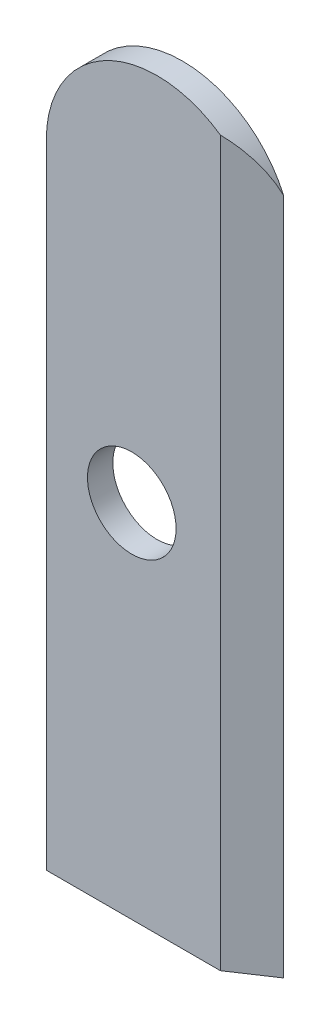
ISO-10303-21;
HEADER;
FILE_DESCRIPTION(('STEP AP214'),'2;1');
FILE_NAME('part.step','',(''),(''),'','','');
FILE_SCHEMA(('AUTOMOTIVE_DESIGN { 1 0 10303 214 1 1 1 1 }'));
ENDSEC;
DATA;
#1=APPLICATION_CONTEXT('core data for automotive mechanical design processes');
#2=APPLICATION_PROTOCOL_DEFINITION('international standard','automotive_design',2000,#1);
#3=PRODUCT_CONTEXT('',#1,'mechanical');
#4=PRODUCT('Part','Part','',(#3));
#5=PRODUCT_RELATED_PRODUCT_CATEGORY('part','',(#4));
#6=PRODUCT_DEFINITION_FORMATION('','',#4);
#7=PRODUCT_DEFINITION_CONTEXT('part definition',#1,'design');
#8=PRODUCT_DEFINITION('design','',#6,#7);
#9=PRODUCT_DEFINITION_SHAPE('','',#8);
#10=(LENGTH_UNIT() NAMED_UNIT(*) SI_UNIT(.MILLI.,.METRE.));
#11=(NAMED_UNIT(*) PLANE_ANGLE_UNIT() SI_UNIT($,.RADIAN.));
#12=(NAMED_UNIT(*) SI_UNIT($,.STERADIAN.) SOLID_ANGLE_UNIT());
#13=UNCERTAINTY_MEASURE_WITH_UNIT(LENGTH_MEASURE(1.E-05),#10,'distance_accuracy_value','');
#14=(GEOMETRIC_REPRESENTATION_CONTEXT(3) GLOBAL_UNCERTAINTY_ASSIGNED_CONTEXT((#13)) GLOBAL_UNIT_ASSIGNED_CONTEXT((#10,
#11,#12)) REPRESENTATION_CONTEXT('',''));
#15=CARTESIAN_POINT('',(0.,0.,0.));
#16=DIRECTION('',(0.,0.,1.));
#17=DIRECTION('',(1.,0.,0.));
#18=AXIS2_PLACEMENT_3D('',#15,#16,#17);
#19=CARTESIAN_POINT('',(-3.5,20.,0.8));
#20=DIRECTION('',(0.,0.,-1.));
#21=DIRECTION('',(-1.,0.,0.));
#22=AXIS2_PLACEMENT_3D('',#19,#20,#21);
#23=CYLINDRICAL_SURFACE('',#22,3.5);
#24=CARTESIAN_POINT('',(-3.5,20.,0.8));
#25=DIRECTION('',(0.,0.,1.));
#26=DIRECTION('',(1.,0.,0.));
#27=AXIS2_PLACEMENT_3D('',#24,#25,#26);
#28=CIRCLE('',#27,3.5);
#29=CARTESIAN_POINT('',(-7.,20.,0.8));
#30=VERTEX_POINT('',#29);
#31=CARTESIAN_POINT('',(-1.50000000000001,22.872281323269,0.8));
#32=VERTEX_POINT('',#31);
#33=EDGE_CURVE('E77',#30,#32,#28,.F.);
#34=ORIENTED_EDGE('',*,*,#33,.T.);
#35=CARTESIAN_POINT('',(-3.5,20.,2.13333333333332));
#36=DIRECTION('',(0.554700196225228,0.,0.832050294337845));
#37=DIRECTION('',(0.832050294337844,0.,-0.554700196225228));
#38=AXIS2_PLACEMENT_3D('',#35,#36,#37);
#39=ELLIPSE('',#38,4.20647648804132,3.5);
#40=CARTESIAN_POINT('',(-0.300000000000001,21.4177446878758,0.));
#41=VERTEX_POINT('',#40);
#42=EDGE_CURVE('E43',#32,#41,#39,.F.);
#43=ORIENTED_EDGE('',*,*,#42,.T.);
#44=CARTESIAN_POINT('',(-3.5,20.,0.));
#45=DIRECTION('',(0.,0.,1.));
#46=DIRECTION('',(1.,0.,0.));
#47=AXIS2_PLACEMENT_3D('',#44,#45,#46);
#48=CIRCLE('',#47,3.5);
#49=CARTESIAN_POINT('',(-7.,20.,0.));
#50=VERTEX_POINT('',#49);
#51=EDGE_CURVE('E79',#50,#41,#48,.F.);
#52=ORIENTED_EDGE('',*,*,#51,.F.);
#53=DIRECTION('',(0.,0.,-1.));
#54=VECTOR('',#53,1.);
#55=CARTESIAN_POINT('',(-7.,20.,0.8));
#56=LINE('',#55,#54);
#57=EDGE_CURVE('E75',#30,#50,#56,.T.);
#58=ORIENTED_EDGE('',*,*,#57,.F.);
#59=EDGE_LOOP('',(#34,#43,#52,#58));
#60=FACE_BOUND('',#59,.T.);
#61=ADVANCED_FACE('F35',(#60),#23,.T.);
#62=CARTESIAN_POINT('',(-7.,0.,0.8));
#63=DIRECTION('',(-1.,0.,0.));
#64=DIRECTION('',(0.,-1.,0.));
#65=AXIS2_PLACEMENT_3D('',#62,#63,#64);
#66=PLANE('',#65);
#67=DIRECTION('',(0.,1.,0.));
#68=VECTOR('',#67,1.);
#69=CARTESIAN_POINT('',(-7.,0.,0.));
#70=LINE('',#69,#68);
#71=CARTESIAN_POINT('',(-7.,0.,0.));
#72=VERTEX_POINT('',#71);
#73=EDGE_CURVE('E101',#72,#50,#70,.T.);
#74=ORIENTED_EDGE('',*,*,#73,.F.);
#75=DIRECTION('',(0.,0.,-1.));
#76=VECTOR('',#75,1.);
#77=CARTESIAN_POINT('',(-7.,0.,0.8));
#78=LINE('',#77,#76);
#79=CARTESIAN_POINT('',(-7.,0.,0.8));
#80=VERTEX_POINT('',#79);
#81=EDGE_CURVE('E85',#80,#72,#78,.T.);
#82=ORIENTED_EDGE('',*,*,#81,.F.);
#83=DIRECTION('',(0.,1.,0.));
#84=VECTOR('',#83,1.);
#85=CARTESIAN_POINT('',(-7.,0.,0.8));
#86=LINE('',#85,#84);
#87=EDGE_CURVE('E90',#80,#30,#86,.T.);
#88=ORIENTED_EDGE('',*,*,#87,.T.);
#89=ORIENTED_EDGE('',*,*,#57,.T.);
#90=EDGE_LOOP('',(#74,#82,#88,#89));
#91=FACE_BOUND('',#90,.T.);
#92=ADVANCED_FACE('F94',(#91),#66,.T.);
#93=CARTESIAN_POINT('',(0.,0.,0.8));
#94=DIRECTION('',(0.,-1.,0.));
#95=DIRECTION('',(0.,0.,-1.));
#96=AXIS2_PLACEMENT_3D('',#93,#94,#95);
#97=PLANE('',#96);
#98=DIRECTION('',(-1.,0.,0.));
#99=VECTOR('',#98,1.);
#100=CARTESIAN_POINT('',(0.,0.,0.));
#101=LINE('',#100,#99);
#102=CARTESIAN_POINT('',(-0.300000000000001,0.,0.));
#103=VERTEX_POINT('',#102);
#104=EDGE_CURVE('E104',#103,#72,#101,.T.);
#105=ORIENTED_EDGE('',*,*,#104,.F.);
#106=DIRECTION('',(-0.832050294337844,0.,0.554700196225228));
#107=VECTOR('',#106,1.);
#108=CARTESIAN_POINT('',(-0.461538461538463,0.,0.107692307692304));
#109=LINE('',#108,#107);
#110=CARTESIAN_POINT('',(-1.50000000000001,0.,0.8));
#111=VERTEX_POINT('',#110);
#112=EDGE_CURVE('E11',#103,#111,#109,.T.);
#113=ORIENTED_EDGE('',*,*,#112,.T.);
#114=DIRECTION('',(-1.,0.,0.));
#115=VECTOR('',#114,1.);
#116=CARTESIAN_POINT('',(0.,0.,0.8));
#117=LINE('',#116,#115);
#118=EDGE_CURVE('E95',#111,#80,#117,.T.);
#119=ORIENTED_EDGE('',*,*,#118,.T.);
#120=ORIENTED_EDGE('',*,*,#81,.T.);
#121=EDGE_LOOP('',(#105,#113,#119,#120));
#122=FACE_BOUND('',#121,.T.);
#123=ADVANCED_FACE('F125',(#122),#97,.T.);
#124=CARTESIAN_POINT('',(0.,0.,0.8));
#125=DIRECTION('',(0.,0.,1.));
#126=DIRECTION('',(1.,0.,0.));
#127=AXIS2_PLACEMENT_3D('',#124,#125,#126);
#128=PLANE('',#127);
#129=CARTESIAN_POINT('',(-4.3,11.4,0.8));
#130=DIRECTION('',(0.,0.,1.));
#131=DIRECTION('',(1.,0.,0.));
#132=AXIS2_PLACEMENT_3D('',#129,#130,#131);
#133=CIRCLE('',#132,1.4);
#134=CARTESIAN_POINT('',(-2.9,11.4,0.8));
#135=VERTEX_POINT('',#134);
#136=EDGE_CURVE('E136',#135,#135,#133,.T.);
#137=ORIENTED_EDGE('',*,*,#136,.F.);
#138=EDGE_LOOP('',(#137));
#139=FACE_BOUND('',#138,.T.);
#140=ORIENTED_EDGE('',*,*,#118,.F.);
#141=DIRECTION('',(0.,1.,0.));
#142=VECTOR('',#141,1.);
#143=CARTESIAN_POINT('',(-1.50000000000001,21.4177446878758,0.8));
#144=LINE('',#143,#142);
#145=EDGE_CURVE('E84',#111,#32,#144,.T.);
#146=ORIENTED_EDGE('',*,*,#145,.T.);
#147=ORIENTED_EDGE('',*,*,#33,.F.);
#148=ORIENTED_EDGE('',*,*,#87,.F.);
#149=EDGE_LOOP('',(#140,#146,#147,#148));
#150=FACE_BOUND('',#149,.T.);
#151=ADVANCED_FACE('F89',(#139,#150),#128,.T.);
#152=CARTESIAN_POINT('',(0.,0.,0.));
#153=DIRECTION('',(0.,0.,1.));
#154=DIRECTION('',(1.,0.,0.));
#155=AXIS2_PLACEMENT_3D('',#152,#153,#154);
#156=PLANE('',#155);
#157=CARTESIAN_POINT('',(-4.3,11.4,0.));
#158=DIRECTION('',(0.,0.,1.));
#159=DIRECTION('',(1.,0.,0.));
#160=AXIS2_PLACEMENT_3D('',#157,#158,#159);
#161=CIRCLE('',#160,1.4);
#162=CARTESIAN_POINT('',(-2.9,11.4,0.));
#163=VERTEX_POINT('',#162);
#164=EDGE_CURVE('E102',#163,#163,#161,.F.);
#165=ORIENTED_EDGE('',*,*,#164,.F.);
#166=EDGE_LOOP('',(#165));
#167=FACE_BOUND('',#166,.T.);
#168=ORIENTED_EDGE('',*,*,#51,.T.);
#169=DIRECTION('',(0.,1.,0.));
#170=VECTOR('',#169,1.);
#171=CARTESIAN_POINT('',(-0.300000000000001,0.,0.));
#172=LINE('',#171,#170);
#173=EDGE_CURVE('E91',#103,#41,#172,.T.);
#174=ORIENTED_EDGE('',*,*,#173,.F.);
#175=ORIENTED_EDGE('',*,*,#104,.T.);
#176=ORIENTED_EDGE('',*,*,#73,.T.);
#177=EDGE_LOOP('',(#168,#174,#175,#176));
#178=FACE_BOUND('',#177,.T.);
#179=ADVANCED_FACE('F110',(#167,#178),#156,.F.);
#180=CARTESIAN_POINT('',(-1.50000000000001,0.,0.8));
#181=DIRECTION('',(0.554700196225228,0.,0.832050294337845));
#182=DIRECTION('',(0.,-1.,0.));
#183=AXIS2_PLACEMENT_3D('',#180,#181,#182);
#184=PLANE('',#183);
#185=ORIENTED_EDGE('',*,*,#112,.F.);
#186=ORIENTED_EDGE('',*,*,#173,.T.);
#187=ORIENTED_EDGE('',*,*,#42,.F.);
#188=ORIENTED_EDGE('',*,*,#145,.F.);
#189=EDGE_LOOP('',(#185,#186,#187,#188));
#190=FACE_BOUND('',#189,.T.);
#191=ADVANCED_FACE('F37',(#190),#184,.T.);
#192=CARTESIAN_POINT('',(-4.3,11.4,-0.00100000000000002));
#193=DIRECTION('',(0.,0.,1.));
#194=DIRECTION('',(1.,0.,0.));
#195=AXIS2_PLACEMENT_3D('',#192,#193,#194);
#196=CYLINDRICAL_SURFACE('',#195,1.4);
#197=CARTESIAN_POINT('',(-2.9,11.4,0.8));
#198=CARTESIAN_POINT('',(-2.9,11.4,0.791666666666667));
#199=CARTESIAN_POINT('',(-2.9,11.4,0.783333333333333));
#200=CARTESIAN_POINT('',(-2.9,11.4,0.766666666666667));
#201=CARTESIAN_POINT('',(-2.9,11.4,0.758333333333333));
#202=CARTESIAN_POINT('',(-2.9,11.4,0.741666666666667));
#203=CARTESIAN_POINT('',(-2.9,11.4,0.733333333333333));
#204=CARTESIAN_POINT('',(-2.9,11.4,0.716666666666667));
#205=CARTESIAN_POINT('',(-2.9,11.4,0.708333333333333));
#206=CARTESIAN_POINT('',(-2.9,11.4,0.691666666666667));
#207=CARTESIAN_POINT('',(-2.9,11.4,0.683333333333333));
#208=CARTESIAN_POINT('',(-2.9,11.4,0.666666666666667));
#209=CARTESIAN_POINT('',(-2.9,11.4,0.658333333333333));
#210=CARTESIAN_POINT('',(-2.9,11.4,0.641666666666667));
#211=CARTESIAN_POINT('',(-2.9,11.4,0.633333333333333));
#212=CARTESIAN_POINT('',(-2.9,11.4,0.616666666666667));
#213=CARTESIAN_POINT('',(-2.9,11.4,0.608333333333333));
#214=CARTESIAN_POINT('',(-2.9,11.4,0.591666666666667));
#215=CARTESIAN_POINT('',(-2.9,11.4,0.583333333333333));
#216=CARTESIAN_POINT('',(-2.9,11.4,0.566666666666667));
#217=CARTESIAN_POINT('',(-2.9,11.4,0.558333333333333));
#218=CARTESIAN_POINT('',(-2.9,11.4,0.541666666666667));
#219=CARTESIAN_POINT('',(-2.9,11.4,0.533333333333333));
#220=CARTESIAN_POINT('',(-2.9,11.4,0.516666666666667));
#221=CARTESIAN_POINT('',(-2.9,11.4,0.508333333333333));
#222=CARTESIAN_POINT('',(-2.9,11.4,0.491666666666667));
#223=CARTESIAN_POINT('',(-2.9,11.4,0.483333333333333));
#224=CARTESIAN_POINT('',(-2.9,11.4,0.466666666666667));
#225=CARTESIAN_POINT('',(-2.9,11.4,0.458333333333333));
#226=CARTESIAN_POINT('',(-2.9,11.4,0.441666666666667));
#227=CARTESIAN_POINT('',(-2.9,11.4,0.433333333333333));
#228=CARTESIAN_POINT('',(-2.9,11.4,0.416666666666667));
#229=CARTESIAN_POINT('',(-2.9,11.4,0.408333333333333));
#230=CARTESIAN_POINT('',(-2.9,11.4,0.391666666666667));
#231=CARTESIAN_POINT('',(-2.9,11.4,0.383333333333333));
#232=CARTESIAN_POINT('',(-2.9,11.4,0.366666666666667));
#233=CARTESIAN_POINT('',(-2.9,11.4,0.358333333333333));
#234=CARTESIAN_POINT('',(-2.9,11.4,0.341666666666667));
#235=CARTESIAN_POINT('',(-2.9,11.4,0.333333333333333));
#236=CARTESIAN_POINT('',(-2.9,11.4,0.316666666666667));
#237=CARTESIAN_POINT('',(-2.9,11.4,0.308333333333333));
#238=CARTESIAN_POINT('',(-2.9,11.4,0.291666666666667));
#239=CARTESIAN_POINT('',(-2.9,11.4,0.283333333333333));
#240=CARTESIAN_POINT('',(-2.9,11.4,0.266666666666667));
#241=CARTESIAN_POINT('',(-2.9,11.4,0.258333333333333));
#242=CARTESIAN_POINT('',(-2.9,11.4,0.241666666666667));
#243=CARTESIAN_POINT('',(-2.9,11.4,0.233333333333333));
#244=CARTESIAN_POINT('',(-2.9,11.4,0.216666666666667));
#245=CARTESIAN_POINT('',(-2.9,11.4,0.208333333333333));
#246=CARTESIAN_POINT('',(-2.9,11.4,0.191666666666667));
#247=CARTESIAN_POINT('',(-2.9,11.4,0.183333333333333));
#248=CARTESIAN_POINT('',(-2.9,11.4,0.166666666666667));
#249=CARTESIAN_POINT('',(-2.9,11.4,0.158333333333333));
#250=CARTESIAN_POINT('',(-2.9,11.4,0.141666666666667));
#251=CARTESIAN_POINT('',(-2.9,11.4,0.133333333333333));
#252=CARTESIAN_POINT('',(-2.9,11.4,0.116666666666667));
#253=CARTESIAN_POINT('',(-2.9,11.4,0.108333333333333));
#254=CARTESIAN_POINT('',(-2.9,11.4,0.0916666666666667));
#255=CARTESIAN_POINT('',(-2.9,11.4,0.0833333333333333));
#256=CARTESIAN_POINT('',(-2.9,11.4,0.0666666666666666));
#257=CARTESIAN_POINT('',(-2.9,11.4,0.0583333333333333));
#258=CARTESIAN_POINT('',(-2.9,11.4,0.0416666666666667));
#259=CARTESIAN_POINT('',(-2.9,11.4,0.0333333333333333));
#260=CARTESIAN_POINT('',(-2.9,11.4,0.0166666666666666));
#261=CARTESIAN_POINT('',(-2.9,11.4,0.00833333333333331));
#262=CARTESIAN_POINT('',(-2.9,11.4,0.));
#263=B_SPLINE_CURVE_WITH_KNOTS('',3,(#197,#198,#199,#200,#201,#202,#203,#204,#205,#206,#207,
#208,#209,#210,#211,#212,#213,#214,#215,#216,#217,#218,#219,#220,#221,#222,#223,#224,#225,#226,
#227,#228,#229,#230,#231,#232,#233,#234,#235,#236,#237,#238,#239,#240,#241,#242,#243,#244,#245,
#246,#247,#248,#249,#250,#251,#252,#253,#254,#255,#256,#257,#258,#259,#260,#261,#262),
.UNSPECIFIED.,.F.,.F.,(4,2,2,2,2,2,2,2,2,2,2,2,2,2,2,2,2,2,2,2,2,2,2,2,2,2,2,2,2,2,2,2,4),(0.,
0.025,0.05,0.075,0.1,0.125,0.15,0.175,0.2,0.225,0.25,0.275,0.3,0.325,0.35,0.375,0.4,0.425,0.45,
0.475,0.5,0.525,0.55,0.575,0.6,0.625,0.65,0.675,0.7,0.725,0.75,0.775,0.8),.UNSPECIFIED.);
#264=EDGE_CURVE('BSEAM112',#135,#163,#263,.T.);
#265=ORIENTED_EDGE('',*,*,#136,.T.);
#266=ORIENTED_EDGE('',*,*,#164,.T.);
#267=ORIENTED_EDGE('',*,*,#264,.T.);
#268=ORIENTED_EDGE('',*,*,#264,.F.);
#269=EDGE_LOOP('',(#265,#267,#266,#268));
#270=FACE_BOUND('',#269,.T.);
#271=ADVANCED_FACE('F112',(#270),#196,.F.);
#272=CLOSED_SHELL('',(#61,#92,#123,#151,#179,#191,#271));
#273=MANIFOLD_SOLID_BREP('B2',#272);
#274=ADVANCED_BREP_SHAPE_REPRESENTATION('',(#18,#273),#14);
#275=SHAPE_DEFINITION_REPRESENTATION(#9,#274);
ENDSEC;
END-ISO-10303-21;
